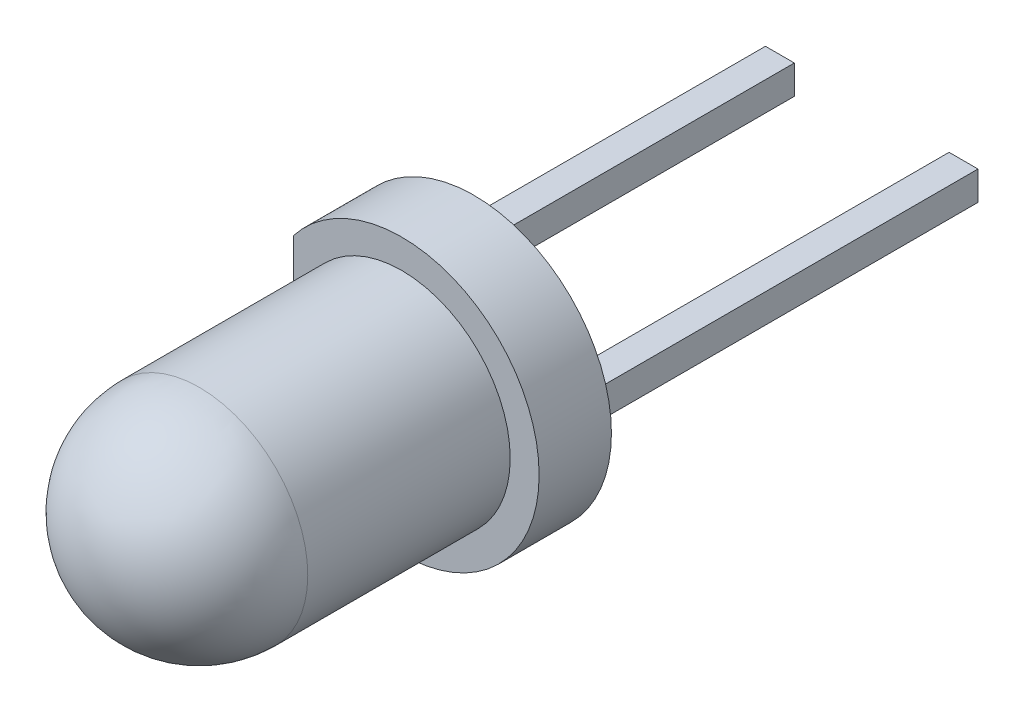
ISO-10303-21;
HEADER;
FILE_DESCRIPTION(('STEP AP214'),'2;1');
FILE_NAME('part.step','',(''),(''),'','','');
FILE_SCHEMA(('AUTOMOTIVE_DESIGN { 1 0 10303 214 1 1 1 1 }'));
ENDSEC;
DATA;
#1=APPLICATION_CONTEXT('core data for automotive mechanical design processes');
#2=APPLICATION_PROTOCOL_DEFINITION('international standard','automotive_design',2000,#1);
#3=PRODUCT_CONTEXT('',#1,'mechanical');
#4=PRODUCT('Part','Part','',(#3));
#5=PRODUCT_RELATED_PRODUCT_CATEGORY('part','',(#4));
#6=PRODUCT_DEFINITION_FORMATION('','',#4);
#7=PRODUCT_DEFINITION_CONTEXT('part definition',#1,'design');
#8=PRODUCT_DEFINITION('design','',#6,#7);
#9=PRODUCT_DEFINITION_SHAPE('','',#8);
#10=(LENGTH_UNIT() NAMED_UNIT(*) SI_UNIT(.MILLI.,.METRE.));
#11=(NAMED_UNIT(*) PLANE_ANGLE_UNIT() SI_UNIT($,.RADIAN.));
#12=(NAMED_UNIT(*) SI_UNIT($,.STERADIAN.) SOLID_ANGLE_UNIT());
#13=UNCERTAINTY_MEASURE_WITH_UNIT(LENGTH_MEASURE(1.E-05),#10,'distance_accuracy_value','');
#14=(GEOMETRIC_REPRESENTATION_CONTEXT(3) GLOBAL_UNCERTAINTY_ASSIGNED_CONTEXT((#13)) GLOBAL_UNIT_ASSIGNED_CONTEXT((#10,
#11,#12)) REPRESENTATION_CONTEXT('',''));
#15=CARTESIAN_POINT('',(0.,0.,0.));
#16=DIRECTION('',(0.,0.,1.));
#17=DIRECTION('',(1.,0.,0.));
#18=AXIS2_PLACEMENT_3D('',#15,#16,#17);
#19=CARTESIAN_POINT('',(-0.2,0.2,3.5));
#20=DIRECTION('',(0.,-1.,0.));
#21=DIRECTION('',(0.,0.,-1.));
#22=AXIS2_PLACEMENT_3D('',#19,#20,#21);
#23=PLANE('',#22);
#24=DIRECTION('',(1.,0.,0.));
#25=VECTOR('',#24,1.);
#26=CARTESIAN_POINT('',(-0.2,0.2,-2.5));
#27=LINE('',#26,#25);
#28=CARTESIAN_POINT('',(0.2,0.2,-2.5));
#29=VERTEX_POINT('',#28);
#30=CARTESIAN_POINT('',(-0.2,0.2,-2.5));
#31=VERTEX_POINT('',#30);
#32=EDGE_CURVE('E116',#29,#31,#27,.F.);
#33=ORIENTED_EDGE('',*,*,#32,.T.);
#34=DIRECTION('',(0.,0.,-1.));
#35=VECTOR('',#34,1.);
#36=CARTESIAN_POINT('',(-0.2,0.2,3.5));
#37=LINE('',#36,#35);
#38=CARTESIAN_POINT('',(-0.2,0.2,3.));
#39=VERTEX_POINT('',#38);
#40=EDGE_CURVE('E108',#31,#39,#37,.F.);
#41=ORIENTED_EDGE('',*,*,#40,.T.);
#42=DIRECTION('',(1.,0.,0.));
#43=VECTOR('',#42,1.);
#44=CARTESIAN_POINT('',(-0.2,0.2,3.));
#45=LINE('',#44,#43);
#46=CARTESIAN_POINT('',(0.2,0.2,3.));
#47=VERTEX_POINT('',#46);
#48=EDGE_CURVE('E98',#47,#39,#45,.F.);
#49=ORIENTED_EDGE('',*,*,#48,.F.);
#50=DIRECTION('',(0.,0.,1.));
#51=VECTOR('',#50,1.);
#52=CARTESIAN_POINT('',(0.2,0.2,3.5));
#53=LINE('',#52,#51);
#54=EDGE_CURVE('E88',#47,#29,#53,.F.);
#55=ORIENTED_EDGE('',*,*,#54,.T.);
#56=EDGE_LOOP('',(#33,#41,#49,#55));
#57=FACE_BOUND('',#56,.T.);
#58=ADVANCED_FACE('F16',(#57),#23,.F.);
#59=CARTESIAN_POINT('',(2.34,-0.2,3.5));
#60=DIRECTION('',(1.,0.,0.));
#61=DIRECTION('',(0.,0.,-1.));
#62=AXIS2_PLACEMENT_3D('',#59,#60,#61);
#63=PLANE('',#62);
#64=DIRECTION('',(0.,1.,0.));
#65=VECTOR('',#64,1.);
#66=CARTESIAN_POINT('',(2.34,0.2,-2.5));
#67=LINE('',#66,#65);
#68=CARTESIAN_POINT('',(2.34,0.2,-2.5));
#69=VERTEX_POINT('',#68);
#70=CARTESIAN_POINT('',(2.34,-0.2,-2.5));
#71=VERTEX_POINT('',#70);
#72=EDGE_CURVE('E67',#69,#71,#67,.F.);
#73=ORIENTED_EDGE('',*,*,#72,.T.);
#74=DIRECTION('',(0.,0.,1.));
#75=VECTOR('',#74,1.);
#76=CARTESIAN_POINT('',(2.34,-0.2,3.5));
#77=LINE('',#76,#75);
#78=CARTESIAN_POINT('',(2.34,-0.2,3.));
#79=VERTEX_POINT('',#78);
#80=EDGE_CURVE('E161',#71,#79,#77,.T.);
#81=ORIENTED_EDGE('',*,*,#80,.T.);
#82=DIRECTION('',(0.,1.,0.));
#83=VECTOR('',#82,1.);
#84=CARTESIAN_POINT('',(2.34,-0.2,3.));
#85=LINE('',#84,#83);
#86=CARTESIAN_POINT('',(2.34,0.2,3.));
#87=VERTEX_POINT('',#86);
#88=EDGE_CURVE('E105',#87,#79,#85,.F.);
#89=ORIENTED_EDGE('',*,*,#88,.F.);
#90=DIRECTION('',(0.,0.,-1.));
#91=VECTOR('',#90,1.);
#92=CARTESIAN_POINT('',(2.34,0.2,3.5));
#93=LINE('',#92,#91);
#94=EDGE_CURVE('E172',#87,#69,#93,.T.);
#95=ORIENTED_EDGE('',*,*,#94,.T.);
#96=EDGE_LOOP('',(#73,#81,#89,#95));
#97=FACE_BOUND('',#96,.T.);
#98=ADVANCED_FACE('F215',(#97),#63,.F.);
#99=CARTESIAN_POINT('',(0.2,0.2,3.5));
#100=DIRECTION('',(-1.,0.,0.));
#101=DIRECTION('',(0.,0.,1.));
#102=AXIS2_PLACEMENT_3D('',#99,#100,#101);
#103=PLANE('',#102);
#104=DIRECTION('',(0.,1.,0.));
#105=VECTOR('',#104,1.);
#106=CARTESIAN_POINT('',(0.2,0.2,-2.5));
#107=LINE('',#106,#105);
#108=CARTESIAN_POINT('',(0.2,-0.2,-2.5));
#109=VERTEX_POINT('',#108);
#110=EDGE_CURVE('E113',#109,#29,#107,.T.);
#111=ORIENTED_EDGE('',*,*,#110,.T.);
#112=ORIENTED_EDGE('',*,*,#54,.F.);
#113=DIRECTION('',(0.,1.,0.));
#114=VECTOR('',#113,1.);
#115=CARTESIAN_POINT('',(0.2,0.2,3.));
#116=LINE('',#115,#114);
#117=CARTESIAN_POINT('',(0.2,-0.2,3.));
#118=VERTEX_POINT('',#117);
#119=EDGE_CURVE('E94',#118,#47,#116,.T.);
#120=ORIENTED_EDGE('',*,*,#119,.F.);
#121=DIRECTION('',(0.,0.,1.));
#122=VECTOR('',#121,1.);
#123=CARTESIAN_POINT('',(0.2,-0.2,3.5));
#124=LINE('',#123,#122);
#125=EDGE_CURVE('E156',#118,#109,#124,.F.);
#126=ORIENTED_EDGE('',*,*,#125,.T.);
#127=EDGE_LOOP('',(#111,#112,#120,#126));
#128=FACE_BOUND('',#127,.T.);
#129=ADVANCED_FACE('F111',(#128),#103,.F.);
#130=CARTESIAN_POINT('',(-0.2,0.2,-2.5));
#131=DIRECTION('',(0.,0.,1.));
#132=DIRECTION('',(1.,0.,0.));
#133=AXIS2_PLACEMENT_3D('',#130,#131,#132);
#134=PLANE('',#133);
#135=ORIENTED_EDGE('',*,*,#110,.F.);
#136=DIRECTION('',(1.,0.,0.));
#137=VECTOR('',#136,1.);
#138=CARTESIAN_POINT('',(0.2,-0.2,-2.5));
#139=LINE('',#138,#137);
#140=CARTESIAN_POINT('',(-0.2,-0.2,-2.5));
#141=VERTEX_POINT('',#140);
#142=EDGE_CURVE('E153',#109,#141,#139,.F.);
#143=ORIENTED_EDGE('',*,*,#142,.T.);
#144=DIRECTION('',(0.,1.,0.));
#145=VECTOR('',#144,1.);
#146=CARTESIAN_POINT('',(-0.2,-0.2,-2.5));
#147=LINE('',#146,#145);
#148=EDGE_CURVE('E177',#141,#31,#147,.T.);
#149=ORIENTED_EDGE('',*,*,#148,.T.);
#150=ORIENTED_EDGE('',*,*,#32,.F.);
#151=EDGE_LOOP('',(#135,#143,#149,#150));
#152=FACE_BOUND('',#151,.T.);
#153=ADVANCED_FACE('F183',(#152),#134,.F.);
#154=CARTESIAN_POINT('',(-0.2,-0.2,3.5));
#155=DIRECTION('',(1.,0.,0.));
#156=DIRECTION('',(0.,0.,-1.));
#157=AXIS2_PLACEMENT_3D('',#154,#155,#156);
#158=PLANE('',#157);
#159=ORIENTED_EDGE('',*,*,#148,.F.);
#160=DIRECTION('',(0.,0.,1.));
#161=VECTOR('',#160,1.);
#162=CARTESIAN_POINT('',(-0.2,-0.2,3.5));
#163=LINE('',#162,#161);
#164=CARTESIAN_POINT('',(-0.2,-0.2,3.));
#165=VERTEX_POINT('',#164);
#166=EDGE_CURVE('E150',#141,#165,#163,.T.);
#167=ORIENTED_EDGE('',*,*,#166,.T.);
#168=DIRECTION('',(0.,1.,0.));
#169=VECTOR('',#168,1.);
#170=CARTESIAN_POINT('',(-0.2,-0.2,3.));
#171=LINE('',#170,#169);
#172=EDGE_CURVE('E180',#39,#165,#171,.F.);
#173=ORIENTED_EDGE('',*,*,#172,.F.);
#174=ORIENTED_EDGE('',*,*,#40,.F.);
#175=EDGE_LOOP('',(#159,#167,#173,#174));
#176=FACE_BOUND('',#175,.T.);
#177=ADVANCED_FACE('F187',(#176),#158,.F.);
#178=CARTESIAN_POINT('',(2.34,0.2,3.5));
#179=DIRECTION('',(0.,-1.,0.));
#180=DIRECTION('',(0.,0.,-1.));
#181=AXIS2_PLACEMENT_3D('',#178,#179,#180);
#182=PLANE('',#181);
#183=DIRECTION('',(1.,0.,0.));
#184=VECTOR('',#183,1.);
#185=CARTESIAN_POINT('',(2.34,0.2,-2.5));
#186=LINE('',#185,#184);
#187=CARTESIAN_POINT('',(2.74,0.2,-2.5));
#188=VERTEX_POINT('',#187);
#189=EDGE_CURVE('E168',#188,#69,#186,.F.);
#190=ORIENTED_EDGE('',*,*,#189,.T.);
#191=ORIENTED_EDGE('',*,*,#94,.F.);
#192=DIRECTION('',(1.,0.,0.));
#193=VECTOR('',#192,1.);
#194=CARTESIAN_POINT('',(2.34,0.2,3.));
#195=LINE('',#194,#193);
#196=CARTESIAN_POINT('',(2.74,0.2,3.));
#197=VERTEX_POINT('',#196);
#198=EDGE_CURVE('E174',#197,#87,#195,.F.);
#199=ORIENTED_EDGE('',*,*,#198,.F.);
#200=DIRECTION('',(0.,0.,1.));
#201=VECTOR('',#200,1.);
#202=CARTESIAN_POINT('',(2.74,0.2,3.5));
#203=LINE('',#202,#201);
#204=EDGE_CURVE('E147',#197,#188,#203,.F.);
#205=ORIENTED_EDGE('',*,*,#204,.T.);
#206=EDGE_LOOP('',(#190,#191,#199,#205));
#207=FACE_BOUND('',#206,.T.);
#208=ADVANCED_FACE('F201',(#207),#182,.F.);
#209=CARTESIAN_POINT('',(2.34,0.2,-2.5));
#210=DIRECTION('',(0.,0.,1.));
#211=DIRECTION('',(1.,0.,0.));
#212=AXIS2_PLACEMENT_3D('',#209,#210,#211);
#213=PLANE('',#212);
#214=DIRECTION('',(0.,1.,0.));
#215=VECTOR('',#214,1.);
#216=CARTESIAN_POINT('',(2.74,0.2,-2.5));
#217=LINE('',#216,#215);
#218=CARTESIAN_POINT('',(2.74,-0.2,-2.5));
#219=VERTEX_POINT('',#218);
#220=EDGE_CURVE('E144',#188,#219,#217,.F.);
#221=ORIENTED_EDGE('',*,*,#220,.T.);
#222=DIRECTION('',(1.,0.,0.));
#223=VECTOR('',#222,1.);
#224=CARTESIAN_POINT('',(2.74,-0.2,-2.5));
#225=LINE('',#224,#223);
#226=EDGE_CURVE('E164',#219,#71,#225,.F.);
#227=ORIENTED_EDGE('',*,*,#226,.T.);
#228=ORIENTED_EDGE('',*,*,#72,.F.);
#229=ORIENTED_EDGE('',*,*,#189,.F.);
#230=EDGE_LOOP('',(#221,#227,#228,#229));
#231=FACE_BOUND('',#230,.T.);
#232=ADVANCED_FACE('F206',(#231),#213,.F.);
#233=CARTESIAN_POINT('',(2.74,-0.2,3.5));
#234=DIRECTION('',(0.,1.,0.));
#235=DIRECTION('',(0.,0.,1.));
#236=AXIS2_PLACEMENT_3D('',#233,#234,#235);
#237=PLANE('',#236);
#238=ORIENTED_EDGE('',*,*,#226,.F.);
#239=DIRECTION('',(0.,0.,1.));
#240=VECTOR('',#239,1.);
#241=CARTESIAN_POINT('',(2.74,-0.2,3.5));
#242=LINE('',#241,#240);
#243=CARTESIAN_POINT('',(2.74,-0.2,3.));
#244=VERTEX_POINT('',#243);
#245=EDGE_CURVE('E141',#219,#244,#242,.T.);
#246=ORIENTED_EDGE('',*,*,#245,.T.);
#247=DIRECTION('',(1.,0.,0.));
#248=VECTOR('',#247,1.);
#249=CARTESIAN_POINT('',(2.74,-0.2,3.));
#250=LINE('',#249,#248);
#251=EDGE_CURVE('E166',#79,#244,#250,.T.);
#252=ORIENTED_EDGE('',*,*,#251,.F.);
#253=ORIENTED_EDGE('',*,*,#80,.F.);
#254=EDGE_LOOP('',(#238,#246,#252,#253));
#255=FACE_BOUND('',#254,.T.);
#256=ADVANCED_FACE('F212',(#255),#237,.F.);
#257=CARTESIAN_POINT('',(-0.23,-1.16619037897,3.));
#258=DIRECTION('',(-1.,0.,0.));
#259=DIRECTION('',(0.,0.,1.));
#260=AXIS2_PLACEMENT_3D('',#257,#258,#259);
#261=PLANE('',#260);
#262=DIRECTION('',(0.,0.,1.));
#263=VECTOR('',#262,1.);
#264=CARTESIAN_POINT('',(-0.23,1.16619037897,3.));
#265=LINE('',#264,#263);
#266=CARTESIAN_POINT('',(-0.23,1.16619037896953,4.));
#267=VERTEX_POINT('',#266);
#268=CARTESIAN_POINT('',(-0.23,1.16619037896953,3.));
#269=VERTEX_POINT('',#268);
#270=EDGE_CURVE('E51',#267,#269,#265,.F.);
#271=ORIENTED_EDGE('',*,*,#270,.T.);
#272=DIRECTION('',(0.,1.,0.));
#273=VECTOR('',#272,1.);
#274=CARTESIAN_POINT('',(-0.23,-1.166190378969,3.));
#275=LINE('',#274,#273);
#276=CARTESIAN_POINT('',(-0.23,-1.16619037896953,3.));
#277=VERTEX_POINT('',#276);
#278=EDGE_CURVE('E133',#277,#269,#275,.T.);
#279=ORIENTED_EDGE('',*,*,#278,.F.);
#280=DIRECTION('',(0.,0.,1.));
#281=VECTOR('',#280,1.);
#282=CARTESIAN_POINT('',(-0.23,-1.16619037897,3.));
#283=LINE('',#282,#281);
#284=CARTESIAN_POINT('',(-0.23,-1.16619037896953,4.));
#285=VERTEX_POINT('',#284);
#286=EDGE_CURVE('E158',#277,#285,#283,.T.);
#287=ORIENTED_EDGE('',*,*,#286,.T.);
#288=DIRECTION('',(0.,1.,0.));
#289=VECTOR('',#288,1.);
#290=CARTESIAN_POINT('',(-0.23,-1.16619037897,4.));
#291=LINE('',#290,#289);
#292=EDGE_CURVE('E19',#285,#267,#291,.T.);
#293=ORIENTED_EDGE('',*,*,#292,.T.);
#294=EDGE_LOOP('',(#271,#279,#287,#293));
#295=FACE_BOUND('',#294,.T.);
#296=ADVANCED_FACE('F248',(#295),#261,.T.);
#297=CARTESIAN_POINT('',(0.2,-0.2,3.5));
#298=DIRECTION('',(0.,1.,0.));
#299=DIRECTION('',(0.,0.,1.));
#300=AXIS2_PLACEMENT_3D('',#297,#298,#299);
#301=PLANE('',#300);
#302=ORIENTED_EDGE('',*,*,#142,.F.);
#303=ORIENTED_EDGE('',*,*,#125,.F.);
#304=DIRECTION('',(-1.,0.,0.));
#305=VECTOR('',#304,1.);
#306=CARTESIAN_POINT('',(-0.23,-0.2,3.));
#307=LINE('',#306,#305);
#308=EDGE_CURVE('E102',#165,#118,#307,.F.);
#309=ORIENTED_EDGE('',*,*,#308,.F.);
#310=ORIENTED_EDGE('',*,*,#166,.F.);
#311=EDGE_LOOP('',(#302,#303,#309,#310));
#312=FACE_BOUND('',#311,.T.);
#313=ADVANCED_FACE('F245',(#312),#301,.F.);
#314=CARTESIAN_POINT('',(2.74,0.2,3.5));
#315=DIRECTION('',(-1.,0.,0.));
#316=DIRECTION('',(0.,0.,1.));
#317=AXIS2_PLACEMENT_3D('',#314,#315,#316);
#318=PLANE('',#317);
#319=ORIENTED_EDGE('',*,*,#220,.F.);
#320=ORIENTED_EDGE('',*,*,#204,.F.);
#321=DIRECTION('',(0.,1.,0.));
#322=VECTOR('',#321,1.);
#323=CARTESIAN_POINT('',(2.74,-1.166190378969,3.));
#324=LINE('',#323,#322);
#325=EDGE_CURVE('E125',#244,#197,#324,.T.);
#326=ORIENTED_EDGE('',*,*,#325,.F.);
#327=ORIENTED_EDGE('',*,*,#245,.F.);
#328=EDGE_LOOP('',(#319,#320,#326,#327));
#329=FACE_BOUND('',#328,.T.);
#330=ADVANCED_FACE('F209',(#329),#318,.F.);
#331=CARTESIAN_POINT('',(-0.23,-1.166190378969,3.));
#332=DIRECTION('',(0.,0.,-1.));
#333=DIRECTION('',(-1.,0.,0.));
#334=AXIS2_PLACEMENT_3D('',#331,#332,#333);
#335=PLANE('',#334);
#336=ORIENTED_EDGE('',*,*,#251,.T.);
#337=ORIENTED_EDGE('',*,*,#325,.T.);
#338=ORIENTED_EDGE('',*,*,#198,.T.);
#339=ORIENTED_EDGE('',*,*,#88,.T.);
#340=EDGE_LOOP('',(#336,#337,#338,#339));
#341=FACE_BOUND('',#340,.T.);
#342=ORIENTED_EDGE('',*,*,#172,.T.);
#343=ORIENTED_EDGE('',*,*,#308,.T.);
#344=ORIENTED_EDGE('',*,*,#119,.T.);
#345=ORIENTED_EDGE('',*,*,#48,.T.);
#346=EDGE_LOOP('',(#342,#343,#344,#345));
#347=FACE_BOUND('',#346,.T.);
#348=CARTESIAN_POINT('',(1.27,0.,3.));
#349=DIRECTION('',(0.,0.,-1.));
#350=DIRECTION('',(-1.,0.,0.));
#351=AXIS2_PLACEMENT_3D('',#348,#349,#350);
#352=CIRCLE('',#351,1.9);
#353=EDGE_CURVE('E124',#277,#269,#352,.F.);
#354=ORIENTED_EDGE('',*,*,#353,.F.);
#355=ORIENTED_EDGE('',*,*,#278,.T.);
#356=EDGE_LOOP('',(#354,#355));
#357=FACE_BOUND('',#356,.T.);
#358=ADVANCED_FACE('F96',(#341,#347,#357),#335,.T.);
#359=CARTESIAN_POINT('',(1.27,0.,3.));
#360=DIRECTION('',(0.,0.,-1.));
#361=DIRECTION('',(-1.,0.,0.));
#362=AXIS2_PLACEMENT_3D('',#359,#360,#361);
#363=CYLINDRICAL_SURFACE('',#362,1.9);
#364=CARTESIAN_POINT('',(1.27,0.,4.));
#365=DIRECTION('',(0.,0.,-1.));
#366=DIRECTION('',(-1.,0.,0.));
#367=AXIS2_PLACEMENT_3D('',#364,#365,#366);
#368=CIRCLE('',#367,1.9);
#369=EDGE_CURVE('E123',#267,#285,#368,.T.);
#370=ORIENTED_EDGE('',*,*,#369,.T.);
#371=ORIENTED_EDGE('',*,*,#286,.F.);
#372=ORIENTED_EDGE('',*,*,#353,.T.);
#373=ORIENTED_EDGE('',*,*,#270,.F.);
#374=EDGE_LOOP('',(#370,#371,#372,#373));
#375=FACE_BOUND('',#374,.T.);
#376=ADVANCED_FACE('F238',(#375),#363,.T.);
#377=CARTESIAN_POINT('',(1.27,0.,6.8));
#378=DIRECTION('',(1.,0.,0.));
#379=DIRECTION('',(0.,1.,0.));
#380=AXIS2_PLACEMENT_3D('',#377,#378,#379);
#381=SPHERICAL_SURFACE('',#380,1.5);
#382=CARTESIAN_POINT('',(1.27,0.,6.8));
#383=DIRECTION('',(0.,0.,-1.));
#384=DIRECTION('',(0.,1.,0.));
#385=AXIS2_PLACEMENT_3D('',#382,#383,#384);
#386=CIRCLE('',#385,1.5);
#387=CARTESIAN_POINT('',(2.77,0.,6.8));
#388=VERTEX_POINT('',#387);
#389=CARTESIAN_POINT('',(-0.23,0.,6.8));
#390=VERTEX_POINT('',#389);
#391=EDGE_CURVE('E122',#388,#390,#386,.T.);
#392=ORIENTED_EDGE('',*,*,#391,.F.);
#393=CARTESIAN_POINT('',(1.27,0.,6.8));
#394=DIRECTION('',(0.,0.,-1.));
#395=DIRECTION('',(0.,1.,0.));
#396=AXIS2_PLACEMENT_3D('',#393,#394,#395);
#397=CIRCLE('',#396,1.5);
#398=EDGE_CURVE('E25',#390,#388,#397,.T.);
#399=ORIENTED_EDGE('',*,*,#398,.F.);
#400=EDGE_LOOP('',(#392,#399));
#401=FACE_BOUND('',#400,.T.);
#402=ADVANCED_FACE('F231',(#401),#381,.T.);
#403=CARTESIAN_POINT('',(-0.23,-1.166190378969,4.));
#404=DIRECTION('',(0.,0.,-1.));
#405=DIRECTION('',(-1.,0.,0.));
#406=AXIS2_PLACEMENT_3D('',#403,#404,#405);
#407=PLANE('',#406);
#408=CARTESIAN_POINT('',(1.27,0.,4.));
#409=DIRECTION('',(0.,0.,-1.));
#410=DIRECTION('',(0.,1.,0.));
#411=AXIS2_PLACEMENT_3D('',#408,#409,#410);
#412=CIRCLE('',#411,1.5);
#413=CARTESIAN_POINT('',(1.27,1.5,4.));
#414=VERTEX_POINT('',#413);
#415=EDGE_CURVE('E11',#414,#414,#412,.F.);
#416=ORIENTED_EDGE('',*,*,#415,.F.);
#417=EDGE_LOOP('',(#416));
#418=FACE_BOUND('',#417,.T.);
#419=ORIENTED_EDGE('',*,*,#292,.F.);
#420=ORIENTED_EDGE('',*,*,#369,.F.);
#421=EDGE_LOOP('',(#419,#420));
#422=FACE_BOUND('',#421,.T.);
#423=ADVANCED_FACE('F225',(#418,#422),#407,.F.);
#424=CARTESIAN_POINT('',(1.27,0.,6.8));
#425=DIRECTION('',(0.,0.,-1.));
#426=DIRECTION('',(0.,1.,0.));
#427=AXIS2_PLACEMENT_3D('',#424,#425,#426);
#428=CYLINDRICAL_SURFACE('',#427,1.5);
#429=ORIENTED_EDGE('',*,*,#398,.T.);
#430=ORIENTED_EDGE('',*,*,#391,.T.);
#431=EDGE_LOOP('',(#429,#430));
#432=FACE_BOUND('',#431,.T.);
#433=ORIENTED_EDGE('',*,*,#415,.T.);
#434=EDGE_LOOP('',(#433));
#435=FACE_BOUND('',#434,.T.);
#436=ADVANCED_FACE('F223',(#432,#435),#428,.T.);
#437=CLOSED_SHELL('',(#58,#98,#129,#153,#177,#208,#232,#256,#296,#313,#330,#358,#376,#402,#423,#436));
#438=MANIFOLD_SOLID_BREP('B1',#437);
#439=ADVANCED_BREP_SHAPE_REPRESENTATION('',(#18,#438),#14);
#440=SHAPE_DEFINITION_REPRESENTATION(#9,#439);
ENDSEC;
END-ISO-10303-21;
